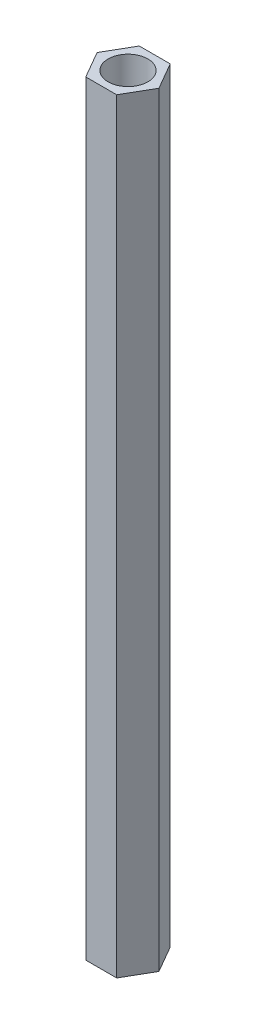
ISO-10303-21;
HEADER;
FILE_DESCRIPTION(('STEP AP214'),'2;1');
FILE_NAME('part.step','',(''),(''),'','','');
FILE_SCHEMA(('AUTOMOTIVE_DESIGN { 1 0 10303 214 1 1 1 1 }'));
ENDSEC;
DATA;
#1=APPLICATION_CONTEXT('core data for automotive mechanical design processes');
#2=APPLICATION_PROTOCOL_DEFINITION('international standard','automotive_design',2000,#1);
#3=PRODUCT_CONTEXT('',#1,'mechanical');
#4=PRODUCT('Part','Part','',(#3));
#5=PRODUCT_RELATED_PRODUCT_CATEGORY('part','',(#4));
#6=PRODUCT_DEFINITION_FORMATION('','',#4);
#7=PRODUCT_DEFINITION_CONTEXT('part definition',#1,'design');
#8=PRODUCT_DEFINITION('design','',#6,#7);
#9=PRODUCT_DEFINITION_SHAPE('','',#8);
#10=(LENGTH_UNIT() NAMED_UNIT(*) SI_UNIT(.MILLI.,.METRE.));
#11=(NAMED_UNIT(*) PLANE_ANGLE_UNIT() SI_UNIT($,.RADIAN.));
#12=(NAMED_UNIT(*) SI_UNIT($,.STERADIAN.) SOLID_ANGLE_UNIT());
#13=UNCERTAINTY_MEASURE_WITH_UNIT(LENGTH_MEASURE(1.E-05),#10,'distance_accuracy_value','');
#14=(GEOMETRIC_REPRESENTATION_CONTEXT(3) GLOBAL_UNCERTAINTY_ASSIGNED_CONTEXT((#13)) GLOBAL_UNIT_ASSIGNED_CONTEXT((#10,
#11,#12)) REPRESENTATION_CONTEXT('',''));
#15=CARTESIAN_POINT('',(0.,0.,0.));
#16=DIRECTION('',(0.,0.,1.));
#17=DIRECTION('',(1.,0.,0.));
#18=AXIS2_PLACEMENT_3D('',#15,#16,#17);
#19=CARTESIAN_POINT('',(0.,0.,0.));
#20=DIRECTION('',(0.,1.,0.));
#21=DIRECTION('',(0.,0.,1.));
#22=AXIS2_PLACEMENT_3D('',#19,#20,#21);
#23=CYLINDRICAL_SURFACE('',#22,2.6);
#24=CARTESIAN_POINT('',(0.,0.,0.));
#25=DIRECTION('',(0.,1.,0.));
#26=DIRECTION('',(0.,0.,1.));
#27=AXIS2_PLACEMENT_3D('',#24,#25,#26);
#28=CIRCLE('',#27,2.6);
#29=CARTESIAN_POINT('',(0.,0.,2.6));
#30=VERTEX_POINT('',#29);
#31=EDGE_CURVE('E127',#30,#30,#28,.T.);
#32=ORIENTED_EDGE('',*,*,#31,.F.);
#33=EDGE_LOOP('',(#32));
#34=FACE_BOUND('',#33,.T.);
#35=CARTESIAN_POINT('',(0.,10.,0.));
#36=DIRECTION('',(0.,1.,0.));
#37=DIRECTION('',(0.,0.,1.));
#38=AXIS2_PLACEMENT_3D('',#35,#36,#37);
#39=CIRCLE('',#38,2.6);
#40=CARTESIAN_POINT('',(0.,10.,2.6));
#41=VERTEX_POINT('',#40);
#42=EDGE_CURVE('E12',#41,#41,#39,.F.);
#43=ORIENTED_EDGE('',*,*,#42,.F.);
#44=EDGE_LOOP('',(#43));
#45=FACE_BOUND('',#44,.T.);
#46=ADVANCED_FACE('F37',(#34,#45),#23,.F.);
#47=CARTESIAN_POINT('',(2.02072594216369,100.,3.5));
#48=DIRECTION('',(-0.866025403784439,0.,-0.5));
#49=DIRECTION('',(-0.5,0.,0.866025403784439));
#50=AXIS2_PLACEMENT_3D('',#47,#48,#49);
#51=PLANE('',#50);
#52=DIRECTION('',(0.5,0.,-0.866025403784439));
#53=VECTOR('',#52,1.);
#54=CARTESIAN_POINT('',(2.02072594216369,0.,3.5));
#55=LINE('',#54,#53);
#56=CARTESIAN_POINT('',(2.02072594216369,0.,3.5));
#57=VERTEX_POINT('',#56);
#58=CARTESIAN_POINT('',(4.04145188432738,0.,0.));
#59=VERTEX_POINT('',#58);
#60=EDGE_CURVE('E123',#57,#59,#55,.T.);
#61=ORIENTED_EDGE('',*,*,#60,.T.);
#62=DIRECTION('',(0.,-1.,0.));
#63=VECTOR('',#62,1.);
#64=CARTESIAN_POINT('',(4.04145188432738,100.,0.));
#65=LINE('',#64,#63);
#66=CARTESIAN_POINT('',(4.04145188432738,100.,0.));
#67=VERTEX_POINT('',#66);
#68=EDGE_CURVE('E46',#67,#59,#65,.T.);
#69=ORIENTED_EDGE('',*,*,#68,.F.);
#70=DIRECTION('',(0.5,0.,-0.866025403784439));
#71=VECTOR('',#70,1.);
#72=CARTESIAN_POINT('',(2.02072594216369,100.,3.5));
#73=LINE('',#72,#71);
#74=CARTESIAN_POINT('',(2.02072594216369,100.,3.5));
#75=VERTEX_POINT('',#74);
#76=EDGE_CURVE('E134',#75,#67,#73,.T.);
#77=ORIENTED_EDGE('',*,*,#76,.F.);
#78=DIRECTION('',(0.,-1.,0.));
#79=VECTOR('',#78,1.);
#80=CARTESIAN_POINT('',(2.02072594216369,100.,3.5));
#81=LINE('',#80,#79);
#82=EDGE_CURVE('E119',#75,#57,#81,.T.);
#83=ORIENTED_EDGE('',*,*,#82,.T.);
#84=EDGE_LOOP('',(#61,#69,#77,#83));
#85=FACE_BOUND('',#84,.T.);
#86=ADVANCED_FACE('F39',(#85),#51,.F.);
#87=CARTESIAN_POINT('',(4.04145188432738,100.,0.));
#88=DIRECTION('',(-0.866025403784439,0.,0.5));
#89=DIRECTION('',(0.5,0.,0.866025403784439));
#90=AXIS2_PLACEMENT_3D('',#87,#88,#89);
#91=PLANE('',#90);
#92=DIRECTION('',(-0.5,0.,-0.866025403784439));
#93=VECTOR('',#92,1.);
#94=CARTESIAN_POINT('',(4.04145188432738,0.,0.));
#95=LINE('',#94,#93);
#96=CARTESIAN_POINT('',(2.02072594216369,0.,-3.5));
#97=VERTEX_POINT('',#96);
#98=EDGE_CURVE('E126',#59,#97,#95,.T.);
#99=ORIENTED_EDGE('',*,*,#98,.T.);
#100=DIRECTION('',(0.,-1.,0.));
#101=VECTOR('',#100,1.);
#102=CARTESIAN_POINT('',(2.02072594216369,100.,-3.5));
#103=LINE('',#102,#101);
#104=CARTESIAN_POINT('',(2.02072594216369,100.,-3.5));
#105=VERTEX_POINT('',#104);
#106=EDGE_CURVE('E138',#105,#97,#103,.T.);
#107=ORIENTED_EDGE('',*,*,#106,.F.);
#108=DIRECTION('',(-0.5,0.,-0.866025403784439));
#109=VECTOR('',#108,1.);
#110=CARTESIAN_POINT('',(4.04145188432738,100.,0.));
#111=LINE('',#110,#109);
#112=EDGE_CURVE('E92',#67,#105,#111,.T.);
#113=ORIENTED_EDGE('',*,*,#112,.F.);
#114=ORIENTED_EDGE('',*,*,#68,.T.);
#115=EDGE_LOOP('',(#99,#107,#113,#114));
#116=FACE_BOUND('',#115,.T.);
#117=ADVANCED_FACE('F141',(#116),#91,.F.);
#118=CARTESIAN_POINT('',(2.02072594216369,100.,-3.5));
#119=DIRECTION('',(0.,0.,1.));
#120=DIRECTION('',(1.,0.,0.));
#121=AXIS2_PLACEMENT_3D('',#118,#119,#120);
#122=PLANE('',#121);
#123=DIRECTION('',(-1.,0.,0.));
#124=VECTOR('',#123,1.);
#125=CARTESIAN_POINT('',(2.02072594216369,0.,-3.5));
#126=LINE('',#125,#124);
#127=CARTESIAN_POINT('',(-2.02072594216369,0.,-3.5));
#128=VERTEX_POINT('',#127);
#129=EDGE_CURVE('E129',#97,#128,#126,.T.);
#130=ORIENTED_EDGE('',*,*,#129,.T.);
#131=DIRECTION('',(0.,-1.,0.));
#132=VECTOR('',#131,1.);
#133=CARTESIAN_POINT('',(-2.02072594216369,100.,-3.5));
#134=LINE('',#133,#132);
#135=CARTESIAN_POINT('',(-2.02072594216369,100.,-3.5));
#136=VERTEX_POINT('',#135);
#137=EDGE_CURVE('E114',#136,#128,#134,.T.);
#138=ORIENTED_EDGE('',*,*,#137,.F.);
#139=DIRECTION('',(-1.,0.,0.));
#140=VECTOR('',#139,1.);
#141=CARTESIAN_POINT('',(2.02072594216369,100.,-3.5));
#142=LINE('',#141,#140);
#143=EDGE_CURVE('E105',#105,#136,#142,.T.);
#144=ORIENTED_EDGE('',*,*,#143,.F.);
#145=ORIENTED_EDGE('',*,*,#106,.T.);
#146=EDGE_LOOP('',(#130,#138,#144,#145));
#147=FACE_BOUND('',#146,.T.);
#148=ADVANCED_FACE('F149',(#147),#122,.F.);
#149=CARTESIAN_POINT('',(-2.02072594216369,100.,-3.5));
#150=DIRECTION('',(0.866025403784438,0.,0.5));
#151=DIRECTION('',(0.5,0.,-0.866025403784438));
#152=AXIS2_PLACEMENT_3D('',#149,#150,#151);
#153=PLANE('',#152);
#154=DIRECTION('',(-0.5,0.,0.866025403784439));
#155=VECTOR('',#154,1.);
#156=CARTESIAN_POINT('',(-2.02072594216369,0.,-3.5));
#157=LINE('',#156,#155);
#158=CARTESIAN_POINT('',(-4.04145188432738,0.,0.));
#159=VERTEX_POINT('',#158);
#160=EDGE_CURVE('E113',#128,#159,#157,.T.);
#161=ORIENTED_EDGE('',*,*,#160,.T.);
#162=DIRECTION('',(0.,-1.,0.));
#163=VECTOR('',#162,1.);
#164=CARTESIAN_POINT('',(-4.04145188432738,100.,0.));
#165=LINE('',#164,#163);
#166=CARTESIAN_POINT('',(-4.04145188432738,100.,0.));
#167=VERTEX_POINT('',#166);
#168=EDGE_CURVE('E110',#167,#159,#165,.T.);
#169=ORIENTED_EDGE('',*,*,#168,.F.);
#170=DIRECTION('',(-0.5,0.,0.866025403784439));
#171=VECTOR('',#170,1.);
#172=CARTESIAN_POINT('',(-2.02072594216369,100.,-3.5));
#173=LINE('',#172,#171);
#174=EDGE_CURVE('E99',#136,#167,#173,.T.);
#175=ORIENTED_EDGE('',*,*,#174,.F.);
#176=ORIENTED_EDGE('',*,*,#137,.T.);
#177=EDGE_LOOP('',(#161,#169,#175,#176));
#178=FACE_BOUND('',#177,.T.);
#179=ADVANCED_FACE('F111',(#178),#153,.F.);
#180=CARTESIAN_POINT('',(-4.04145188432738,100.,0.));
#181=DIRECTION('',(0.866025403784439,0.,-0.5));
#182=DIRECTION('',(-0.5,0.,-0.866025403784439));
#183=AXIS2_PLACEMENT_3D('',#180,#181,#182);
#184=PLANE('',#183);
#185=DIRECTION('',(0.5,0.,0.866025403784439));
#186=VECTOR('',#185,1.);
#187=CARTESIAN_POINT('',(-4.04145188432738,0.,0.));
#188=LINE('',#187,#186);
#189=CARTESIAN_POINT('',(-2.02072594216369,0.,3.5));
#190=VERTEX_POINT('',#189);
#191=EDGE_CURVE('E77',#159,#190,#188,.T.);
#192=ORIENTED_EDGE('',*,*,#191,.T.);
#193=DIRECTION('',(0.,-1.,0.));
#194=VECTOR('',#193,1.);
#195=CARTESIAN_POINT('',(-2.02072594216369,100.,3.5));
#196=LINE('',#195,#194);
#197=CARTESIAN_POINT('',(-2.02072594216369,100.,3.5));
#198=VERTEX_POINT('',#197);
#199=EDGE_CURVE('E115',#198,#190,#196,.T.);
#200=ORIENTED_EDGE('',*,*,#199,.F.);
#201=DIRECTION('',(0.5,0.,0.866025403784439));
#202=VECTOR('',#201,1.);
#203=CARTESIAN_POINT('',(-4.04145188432738,100.,0.));
#204=LINE('',#203,#202);
#205=EDGE_CURVE('E103',#167,#198,#204,.T.);
#206=ORIENTED_EDGE('',*,*,#205,.F.);
#207=ORIENTED_EDGE('',*,*,#168,.T.);
#208=EDGE_LOOP('',(#192,#200,#206,#207));
#209=FACE_BOUND('',#208,.T.);
#210=ADVANCED_FACE('F117',(#209),#184,.F.);
#211=CARTESIAN_POINT('',(-2.02072594216369,100.,3.5));
#212=DIRECTION('',(0.,0.,-1.));
#213=DIRECTION('',(-1.,0.,0.));
#214=AXIS2_PLACEMENT_3D('',#211,#212,#213);
#215=PLANE('',#214);
#216=DIRECTION('',(1.,0.,0.));
#217=VECTOR('',#216,1.);
#218=CARTESIAN_POINT('',(-2.02072594216369,0.,3.5));
#219=LINE('',#218,#217);
#220=EDGE_CURVE('E83',#190,#57,#219,.T.);
#221=ORIENTED_EDGE('',*,*,#220,.T.);
#222=ORIENTED_EDGE('',*,*,#82,.F.);
#223=DIRECTION('',(1.,0.,0.));
#224=VECTOR('',#223,1.);
#225=CARTESIAN_POINT('',(-2.02072594216369,100.,3.5));
#226=LINE('',#225,#224);
#227=EDGE_CURVE('E54',#198,#75,#226,.T.);
#228=ORIENTED_EDGE('',*,*,#227,.F.);
#229=ORIENTED_EDGE('',*,*,#199,.T.);
#230=EDGE_LOOP('',(#221,#222,#228,#229));
#231=FACE_BOUND('',#230,.T.);
#232=ADVANCED_FACE('F172',(#231),#215,.F.);
#233=CARTESIAN_POINT('',(0.,100.,0.));
#234=DIRECTION('',(0.,1.,0.));
#235=DIRECTION('',(0.,0.,1.));
#236=AXIS2_PLACEMENT_3D('',#233,#234,#235);
#237=PLANE('',#236);
#238=CARTESIAN_POINT('',(0.,100.,0.));
#239=DIRECTION('',(0.,1.,0.));
#240=DIRECTION('',(0.,0.,1.));
#241=AXIS2_PLACEMENT_3D('',#238,#239,#240);
#242=CIRCLE('',#241,2.6);
#243=CARTESIAN_POINT('',(0.,100.,2.6));
#244=VERTEX_POINT('',#243);
#245=EDGE_CURVE('E153',#244,#244,#242,.T.);
#246=ORIENTED_EDGE('',*,*,#245,.F.);
#247=EDGE_LOOP('',(#246));
#248=FACE_BOUND('',#247,.T.);
#249=ORIENTED_EDGE('',*,*,#76,.T.);
#250=ORIENTED_EDGE('',*,*,#112,.T.);
#251=ORIENTED_EDGE('',*,*,#143,.T.);
#252=ORIENTED_EDGE('',*,*,#174,.T.);
#253=ORIENTED_EDGE('',*,*,#205,.T.);
#254=ORIENTED_EDGE('',*,*,#227,.T.);
#255=EDGE_LOOP('',(#249,#250,#251,#252,#253,#254));
#256=FACE_BOUND('',#255,.T.);
#257=ADVANCED_FACE('F101',(#248,#256),#237,.T.);
#258=CARTESIAN_POINT('',(0.,0.,0.));
#259=DIRECTION('',(0.,1.,0.));
#260=DIRECTION('',(0.,0.,1.));
#261=AXIS2_PLACEMENT_3D('',#258,#259,#260);
#262=PLANE('',#261);
#263=ORIENTED_EDGE('',*,*,#31,.T.);
#264=EDGE_LOOP('',(#263));
#265=FACE_BOUND('',#264,.T.);
#266=ORIENTED_EDGE('',*,*,#60,.F.);
#267=ORIENTED_EDGE('',*,*,#220,.F.);
#268=ORIENTED_EDGE('',*,*,#191,.F.);
#269=ORIENTED_EDGE('',*,*,#160,.F.);
#270=ORIENTED_EDGE('',*,*,#129,.F.);
#271=ORIENTED_EDGE('',*,*,#98,.F.);
#272=EDGE_LOOP('',(#266,#267,#268,#269,#270,#271));
#273=FACE_BOUND('',#272,.T.);
#274=ADVANCED_FACE('F146',(#265,#273),#262,.F.);
#275=CARTESIAN_POINT('',(0.,90.,0.));
#276=DIRECTION('',(0.,1.,0.));
#277=DIRECTION('',(0.,0.,1.));
#278=AXIS2_PLACEMENT_3D('',#275,#276,#277);
#279=CIRCLE('',#278,2.6);
#280=CARTESIAN_POINT('',(0.,90.,2.6));
#281=VERTEX_POINT('',#280);
#282=EDGE_CURVE('E156',#281,#281,#279,.T.);
#283=ORIENTED_EDGE('',*,*,#282,.F.);
#284=EDGE_LOOP('',(#283));
#285=FACE_BOUND('',#284,.T.);
#286=ORIENTED_EDGE('',*,*,#245,.T.);
#287=EDGE_LOOP('',(#286));
#288=FACE_BOUND('',#287,.T.);
#289=ADVANCED_FACE('F164',(#285,#288),#23,.F.);
#290=CARTESIAN_POINT('',(0.,10.,0.));
#291=DIRECTION('',(0.,1.,0.));
#292=DIRECTION('',(0.,0.,1.));
#293=AXIS2_PLACEMENT_3D('',#290,#291,#292);
#294=PLANE('',#293);
#295=ORIENTED_EDGE('',*,*,#42,.T.);
#296=EDGE_LOOP('',(#295));
#297=FACE_BOUND('',#296,.T.);
#298=ADVANCED_FACE('F167',(#297),#294,.F.);
#299=CARTESIAN_POINT('',(0.,90.,0.));
#300=DIRECTION('',(0.,1.,0.));
#301=DIRECTION('',(0.,0.,1.));
#302=AXIS2_PLACEMENT_3D('',#299,#300,#301);
#303=PLANE('',#302);
#304=ORIENTED_EDGE('',*,*,#282,.T.);
#305=EDGE_LOOP('',(#304));
#306=FACE_BOUND('',#305,.T.);
#307=ADVANCED_FACE('F162',(#306),#303,.T.);
#308=CLOSED_SHELL('',(#46,#86,#117,#148,#179,#210,#232,#257,#274,#289,#298,#307));
#309=MANIFOLD_SOLID_BREP('B2',#308);
#310=ADVANCED_BREP_SHAPE_REPRESENTATION('',(#18,#309),#14);
#311=SHAPE_DEFINITION_REPRESENTATION(#9,#310);
ENDSEC;
END-ISO-10303-21;
